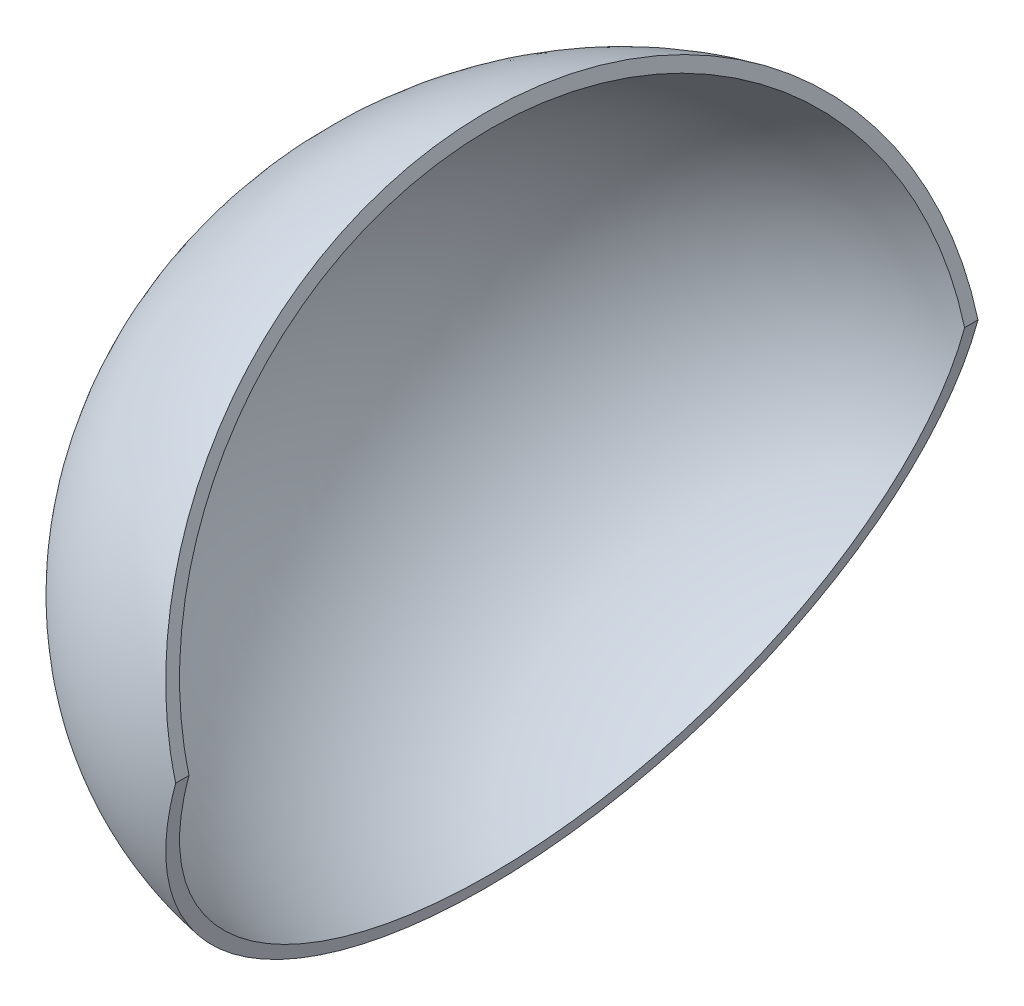
ISO-10303-21;
HEADER;
FILE_DESCRIPTION(('STEP AP214'),'2;1');
FILE_NAME('part.step','',(''),(''),'','','');
FILE_SCHEMA(('AUTOMOTIVE_DESIGN { 1 0 10303 214 1 1 1 1 }'));
ENDSEC;
DATA;
#1=APPLICATION_CONTEXT('core data for automotive mechanical design processes');
#2=APPLICATION_PROTOCOL_DEFINITION('international standard','automotive_design',2000,#1);
#3=PRODUCT_CONTEXT('',#1,'mechanical');
#4=PRODUCT('Part','Part','',(#3));
#5=PRODUCT_RELATED_PRODUCT_CATEGORY('part','',(#4));
#6=PRODUCT_DEFINITION_FORMATION('','',#4);
#7=PRODUCT_DEFINITION_CONTEXT('part definition',#1,'design');
#8=PRODUCT_DEFINITION('design','',#6,#7);
#9=PRODUCT_DEFINITION_SHAPE('','',#8);
#10=(LENGTH_UNIT() NAMED_UNIT(*) SI_UNIT(.MILLI.,.METRE.));
#11=(NAMED_UNIT(*) PLANE_ANGLE_UNIT() SI_UNIT($,.RADIAN.));
#12=(NAMED_UNIT(*) SI_UNIT($,.STERADIAN.) SOLID_ANGLE_UNIT());
#13=UNCERTAINTY_MEASURE_WITH_UNIT(LENGTH_MEASURE(1.E-05),#10,'distance_accuracy_value','');
#14=(GEOMETRIC_REPRESENTATION_CONTEXT(3) GLOBAL_UNCERTAINTY_ASSIGNED_CONTEXT((#13)) GLOBAL_UNIT_ASSIGNED_CONTEXT((#10,
#11,#12)) REPRESENTATION_CONTEXT('',''));
#15=CARTESIAN_POINT('',(0.,0.,0.));
#16=DIRECTION('',(0.,0.,1.));
#17=DIRECTION('',(1.,0.,0.));
#18=AXIS2_PLACEMENT_3D('',#15,#16,#17);
#19=CARTESIAN_POINT('',(0.,0.,-14.5));
#20=CARTESIAN_POINT('',(-0.42128445777828,-1.57225500086767,-14.5));
#21=CARTESIAN_POINT('',(-1.26246119860138,-4.71156933576472,-13.7549454115185));
#22=CARTESIAN_POINT('',(-2.3402054211983,-8.73376553206028,-10.5501070201667));
#23=CARTESIAN_POINT('',(-3.06494768379219,-11.4385404784531,-5.71944519935059));
#24=CARTESIAN_POINT('',(-3.32038325377611,-12.3918390036935,0.));
#25=CARTESIAN_POINT('',(-3.06494768379219,-11.4385404784531,5.71944519935059));
#26=CARTESIAN_POINT('',(-2.3402054211983,-8.73376553206028,10.5501070201667));
#27=CARTESIAN_POINT('',(-1.26246119860138,-4.71156933576473,13.7549454115185));
#28=CARTESIAN_POINT('',(-0.421284457778281,-1.57225500086767,14.5));
#29=CARTESIAN_POINT('',(0.,0.,14.5));
#30=B_SPLINE_CURVE_WITH_KNOTS('',3,(#19,#20,#21,#22,#23,#24,#25,#26,#27,#28,#29),.UNSPECIFIED.,
.F.,.F.,(4,1,1,1,1,1,1,1,4),(0.,0.392699081698724,0.785398163397448,1.17809724509617,
1.5707963267949,1.96349540849362,2.35619449019234,2.74889357189107,3.14159265358979),.UNSPECIFIED.);
#31=CARTESIAN_POINT('',(0.,0.,-15.));
#32=DIRECTION('',(0.,0.,-1.));
#33=AXIS1_PLACEMENT('',#31,#32);
#34=SURFACE_OF_REVOLUTION('',#30,#33);
#35=CARTESIAN_POINT('',(0.,0.,-14.5));
#36=CARTESIAN_POINT('',(-0.421284457778282,1.57225500086767,-14.5));
#37=CARTESIAN_POINT('',(-1.26246119860138,4.71156933576472,-13.7549454115185));
#38=CARTESIAN_POINT('',(-2.3402054211983,8.73376553206028,-10.5501070201667));
#39=CARTESIAN_POINT('',(-3.06494768379219,11.4385404784531,-5.71944519935059));
#40=CARTESIAN_POINT('',(-3.32038325377612,12.3918390036935,0.));
#41=CARTESIAN_POINT('',(-3.06494768379219,11.4385404784531,5.71944519935059));
#42=CARTESIAN_POINT('',(-2.3402054211983,8.73376553206028,10.5501070201667));
#43=CARTESIAN_POINT('',(-1.26246119860138,4.71156933576472,13.7549454115185));
#44=CARTESIAN_POINT('',(-0.421284457778282,1.57225500086767,14.5));
#45=CARTESIAN_POINT('',(0.,0.,14.5));
#46=B_SPLINE_CURVE_WITH_KNOTS('',3,(#35,#36,#37,#38,#39,#40,#41,#42,#43,#44,#45),.UNSPECIFIED.,
.F.,.F.,(4,1,1,1,1,1,1,1,4),(0.,0.392699081698724,0.785398163397448,1.17809724509617,
1.5707963267949,1.96349540849362,2.35619449019234,2.74889357189107,3.14159265358979),.UNSPECIFIED.);
#47=CARTESIAN_POINT('',(0.,0.,-14.5));
#48=VERTEX_POINT('',#47);
#49=CARTESIAN_POINT('',(0.,0.,14.5));
#50=VERTEX_POINT('',#49);
#51=EDGE_CURVE('E53',#48,#50,#46,.T.);
#52=ORIENTED_EDGE('',*,*,#51,.T.);
#53=EDGE_CURVE('E68',#48,#50,#30,.T.);
#54=ORIENTED_EDGE('',*,*,#53,.F.);
#55=EDGE_LOOP('',(#52,#54));
#56=FACE_BOUND('',#55,.T.);
#57=ADVANCED_FACE('F39',(#56),#34,.T.);
#58=CARTESIAN_POINT('',(0.,0.,0.));
#59=DIRECTION('',(-0.965925826289069,0.258819045102518,0.));
#60=DIRECTION('',(0.,0.,-1.));
#61=AXIS2_PLACEMENT_3D('',#58,#59,#60);
#62=ELLIPSE('',#61,15.,13.);
#63=TRIMMED_CURVE('',#62,(PARAMETER_VALUE(0.)),(PARAMETER_VALUE(3.14159265358979)),.T.,.PARAMETER.);
#64=CARTESIAN_POINT('',(0.,0.,-15.));
#65=DIRECTION('',(0.,0.,-1.));
#66=AXIS1_PLACEMENT('',#64,#65);
#67=SURFACE_OF_REVOLUTION('',#63,#66);
#68=CARTESIAN_POINT('',(0.,0.,0.));
#69=DIRECTION('',(0.965925826289069,0.258819045102518,0.));
#70=DIRECTION('',(0.,0.,-1.));
#71=AXIS2_PLACEMENT_3D('',#68,#69,#70);
#72=ELLIPSE('',#71,15.,13.);
#73=CARTESIAN_POINT('',(0.,0.,-15.));
#74=VERTEX_POINT('',#73);
#75=CARTESIAN_POINT('',(0.,0.,15.));
#76=VERTEX_POINT('',#75);
#77=EDGE_CURVE('E73',#74,#76,#72,.T.);
#78=ORIENTED_EDGE('',*,*,#77,.F.);
#79=EDGE_CURVE('E47',#74,#76,#62,.T.);
#80=ORIENTED_EDGE('',*,*,#79,.T.);
#81=EDGE_LOOP('',(#78,#80));
#82=FACE_BOUND('',#81,.T.);
#83=ADVANCED_FACE('F41',(#82),#67,.F.);
#84=CARTESIAN_POINT('',(0.,0.,0.));
#85=DIRECTION('',(-0.965925826289069,0.258819045102518,0.));
#86=DIRECTION('',(0.,0.,1.));
#87=AXIS2_PLACEMENT_3D('',#84,#85,#86);
#88=PLANE('',#87);
#89=ORIENTED_EDGE('',*,*,#53,.T.);
#90=DIRECTION('',(0.,0.,1.));
#91=VECTOR('',#90,1.);
#92=CARTESIAN_POINT('',(0.,0.,0.));
#93=LINE('',#92,#91);
#94=EDGE_CURVE('E11',#50,#76,#93,.T.);
#95=ORIENTED_EDGE('',*,*,#94,.T.);
#96=ORIENTED_EDGE('',*,*,#79,.F.);
#97=DIRECTION('',(0.,0.,1.));
#98=VECTOR('',#97,1.);
#99=CARTESIAN_POINT('',(0.,0.,0.));
#100=LINE('',#99,#98);
#101=EDGE_CURVE('E66',#74,#48,#100,.T.);
#102=ORIENTED_EDGE('',*,*,#101,.T.);
#103=EDGE_LOOP('',(#89,#95,#96,#102));
#104=FACE_BOUND('',#103,.T.);
#105=ADVANCED_FACE('F67',(#104),#88,.F.);
#106=CARTESIAN_POINT('',(0.,0.,0.));
#107=DIRECTION('',(0.965925826289069,0.258819045102518,0.));
#108=DIRECTION('',(0.,0.,1.));
#109=AXIS2_PLACEMENT_3D('',#106,#107,#108);
#110=PLANE('',#109);
#111=ORIENTED_EDGE('',*,*,#51,.F.);
#112=ORIENTED_EDGE('',*,*,#101,.F.);
#113=ORIENTED_EDGE('',*,*,#77,.T.);
#114=ORIENTED_EDGE('',*,*,#94,.F.);
#115=EDGE_LOOP('',(#111,#112,#113,#114));
#116=FACE_BOUND('',#115,.T.);
#117=ADVANCED_FACE('F72',(#116),#110,.T.);
#118=CLOSED_SHELL('',(#57,#83,#105,#117));
#119=MANIFOLD_SOLID_BREP('B2',#118);
#120=ADVANCED_BREP_SHAPE_REPRESENTATION('',(#18,#119),#14);
#121=SHAPE_DEFINITION_REPRESENTATION(#9,#120);
ENDSEC;
END-ISO-10303-21;
